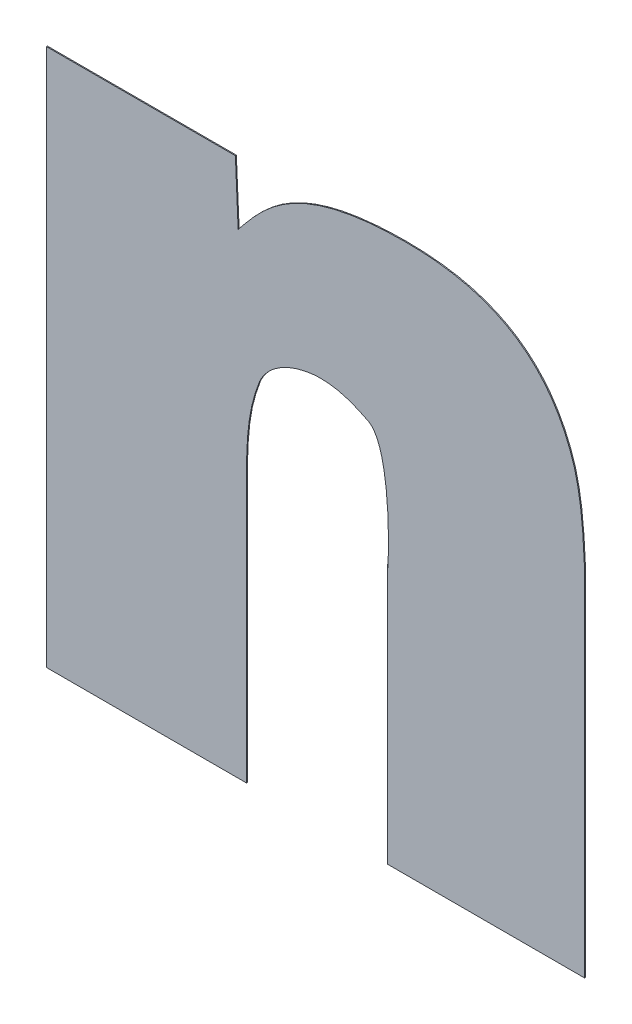
ISO-10303-21;
HEADER;
FILE_DESCRIPTION(('STEP AP214'),'2;1');
FILE_NAME('part.step','',(''),(''),'','','');
FILE_SCHEMA(('AUTOMOTIVE_DESIGN { 1 0 10303 214 1 1 1 1 }'));
ENDSEC;
DATA;
#1=APPLICATION_CONTEXT('core data for automotive mechanical design processes');
#2=APPLICATION_PROTOCOL_DEFINITION('international standard','automotive_design',2000,#1);
#3=PRODUCT_CONTEXT('',#1,'mechanical');
#4=PRODUCT('Part','Part','',(#3));
#5=PRODUCT_RELATED_PRODUCT_CATEGORY('part','',(#4));
#6=PRODUCT_DEFINITION_FORMATION('','',#4);
#7=PRODUCT_DEFINITION_CONTEXT('part definition',#1,'design');
#8=PRODUCT_DEFINITION('design','',#6,#7);
#9=PRODUCT_DEFINITION_SHAPE('','',#8);
#10=(LENGTH_UNIT() NAMED_UNIT(*) SI_UNIT(.MILLI.,.METRE.));
#11=(NAMED_UNIT(*) PLANE_ANGLE_UNIT() SI_UNIT($,.RADIAN.));
#12=(NAMED_UNIT(*) SI_UNIT($,.STERADIAN.) SOLID_ANGLE_UNIT());
#13=UNCERTAINTY_MEASURE_WITH_UNIT(LENGTH_MEASURE(1.E-05),#10,'distance_accuracy_value','');
#14=(GEOMETRIC_REPRESENTATION_CONTEXT(3) GLOBAL_UNCERTAINTY_ASSIGNED_CONTEXT((#13)) GLOBAL_UNIT_ASSIGNED_CONTEXT((#10,
#11,#12)) REPRESENTATION_CONTEXT('',''));
#15=CARTESIAN_POINT('',(0.,0.,0.));
#16=DIRECTION('',(0.,0.,1.));
#17=DIRECTION('',(1.,0.,0.));
#18=AXIS2_PLACEMENT_3D('',#15,#16,#17);
#19=CARTESIAN_POINT('',(2.2675373932652,-0.252027949944998,0.));
#20=DIRECTION('',(0.,1.,0.));
#21=DIRECTION('',(-1.,0.,0.));
#22=AXIS2_PLACEMENT_3D('',#19,#20,#21);
#23=PLANE('',#22);
#24=DIRECTION('',(1.,0.,0.));
#25=VECTOR('',#24,1.);
#26=CARTESIAN_POINT('',(2.2483595272321,-0.252027949944998,0.));
#27=LINE('',#26,#25);
#28=CARTESIAN_POINT('',(2.2483595272321,-0.252027949944998,0.));
#29=VERTEX_POINT('',#28);
#30=CARTESIAN_POINT('',(2.2675373932652,-0.252027949944998,0.));
#31=VERTEX_POINT('',#30);
#32=EDGE_CURVE('E11',#29,#31,#27,.T.);
#33=ORIENTED_EDGE('',*,*,#32,.F.);
#34=DIRECTION('',(0.,0.,1.));
#35=VECTOR('',#34,1.);
#36=CARTESIAN_POINT('',(2.2483595272321,-0.252027949944998,0.));
#37=LINE('',#36,#35);
#38=CARTESIAN_POINT('',(2.2483595272321,-0.252027949944998,0.0001));
#39=VERTEX_POINT('',#38);
#40=EDGE_CURVE('E24',#29,#39,#37,.T.);
#41=ORIENTED_EDGE('',*,*,#40,.T.);
#42=DIRECTION('',(-1.,0.,0.));
#43=VECTOR('',#42,1.);
#44=CARTESIAN_POINT('',(2.2483595272321,-0.252027949944998,0.0001));
#45=LINE('',#44,#43);
#46=CARTESIAN_POINT('',(2.2675373932652,-0.252027949944998,0.0001));
#47=VERTEX_POINT('',#46);
#48=EDGE_CURVE('E142',#47,#39,#45,.T.);
#49=ORIENTED_EDGE('',*,*,#48,.F.);
#50=DIRECTION('',(0.,0.,1.));
#51=VECTOR('',#50,1.);
#52=CARTESIAN_POINT('',(2.2675373932652,-0.252027949944998,0.));
#53=LINE('',#52,#51);
#54=EDGE_CURVE('E309',#31,#47,#53,.T.);
#55=ORIENTED_EDGE('',*,*,#54,.F.);
#56=EDGE_LOOP('',(#33,#41,#49,#55));
#57=FACE_BOUND('',#56,.T.);
#58=ADVANCED_FACE('F17',(#57),#23,.T.);
#59=CARTESIAN_POINT('',(2.2678194264937,-0.258364169610847,0.));
#60=DIRECTION('',(0.999010842697862,0.0444672483082399,0.));
#61=DIRECTION('',(-0.0444672483082399,0.999010842697862,0.));
#62=AXIS2_PLACEMENT_3D('',#59,#60,#61);
#63=PLANE('',#62);
#64=DIRECTION('',(0.0444672483082399,-0.999010842697862,0.));
#65=VECTOR('',#64,1.);
#66=CARTESIAN_POINT('',(2.2675373932652,-0.252027949944998,0.));
#67=LINE('',#66,#65);
#68=CARTESIAN_POINT('',(2.2678194264937,-0.258364169610847,0.));
#69=VERTEX_POINT('',#68);
#70=EDGE_CURVE('E307',#31,#69,#67,.T.);
#71=ORIENTED_EDGE('',*,*,#70,.F.);
#72=ORIENTED_EDGE('',*,*,#54,.T.);
#73=DIRECTION('',(-0.0444672483082399,0.999010842697862,0.));
#74=VECTOR('',#73,1.);
#75=CARTESIAN_POINT('',(2.2675373932652,-0.252027949944998,0.0001));
#76=LINE('',#75,#74);
#77=CARTESIAN_POINT('',(2.2678194264937,-0.258364169610847,0.0001));
#78=VERTEX_POINT('',#77);
#79=EDGE_CURVE('E305',#78,#47,#76,.T.);
#80=ORIENTED_EDGE('',*,*,#79,.F.);
#81=DIRECTION('',(0.,0.,1.));
#82=VECTOR('',#81,1.);
#83=CARTESIAN_POINT('',(2.2678194264937,-0.258364169610847,0.));
#84=LINE('',#83,#82);
#85=EDGE_CURVE('E299',#69,#78,#84,.T.);
#86=ORIENTED_EDGE('',*,*,#85,.F.);
#87=EDGE_LOOP('',(#71,#72,#80,#86));
#88=FACE_BOUND('',#87,.T.);
#89=ADVANCED_FACE('F359',(#88),#63,.T.);
#90=CARTESIAN_POINT('',(2.2848351001338,-0.250975047394927,0.));
#91=CARTESIAN_POINT('',(2.2848351001338,-0.250975047394927,0.0001));
#92=CARTESIAN_POINT('',(2.2735539969308,-0.250975047515781,0.));
#93=CARTESIAN_POINT('',(2.2735539969308,-0.250975047515781,0.0001));
#94=CARTESIAN_POINT('',(2.2704516958387,-0.255139675765826,0.));
#95=CARTESIAN_POINT('',(2.2704516958387,-0.255139675765826,0.0001));
#96=CARTESIAN_POINT('',(2.2678194264937,-0.258364169610847,0.));
#97=CARTESIAN_POINT('',(2.2678194264937,-0.258364169610847,0.0001));
#98=B_SPLINE_SURFACE_WITH_KNOTS('',3,1,((#90,#91),(#92,#93),(#94,#95),(#96,#97)),.UNSPECIFIED.,
.F.,.F.,.F.,(4,4),(2,2),(-1.,0.),(0.,1.E-05),.UNSPECIFIED.);
#99=CARTESIAN_POINT('',(2.2678194264937,-0.258364169610847,0.));
#100=CARTESIAN_POINT('',(2.2704516958387,-0.255139675765826,0.));
#101=CARTESIAN_POINT('',(2.2735539969308,-0.250975047515781,0.));
#102=CARTESIAN_POINT('',(2.2848351001338,-0.250975047394927,0.));
#103=B_SPLINE_CURVE_WITH_KNOTS('',3,(#99,#100,#101,#102),.UNSPECIFIED.,.F.,.F.,(4,4),(0.,1.),.UNSPECIFIED.);
#104=CARTESIAN_POINT('',(2.2848351001338,-0.250975047394927,0.));
#105=VERTEX_POINT('',#104);
#106=EDGE_CURVE('E292',#69,#105,#103,.T.);
#107=CARTESIAN_POINT('',(2.2848351001338,-0.250975047394927,0.0001));
#108=CARTESIAN_POINT('',(2.2735539969308,-0.250975047515781,0.0001));
#109=CARTESIAN_POINT('',(2.2704516958387,-0.255139675765826,0.0001));
#110=CARTESIAN_POINT('',(2.2678194264937,-0.258364169610847,0.0001));
#111=B_SPLINE_CURVE_WITH_KNOTS('',3,(#107,#108,#109,#110),.UNSPECIFIED.,.F.,.F.,(4,4),(-1.,0.),.UNSPECIFIED.);
#112=CARTESIAN_POINT('',(2.2848351001338,-0.250975047394927,0.0001));
#113=VERTEX_POINT('',#112);
#114=EDGE_CURVE('E287',#113,#78,#111,.T.);
#115=DIRECTION('',(0.,0.,1.));
#116=VECTOR('',#115,1.);
#117=CARTESIAN_POINT('',(2.2848351001338,-0.250975047394927,0.));
#118=LINE('',#117,#116);
#119=EDGE_CURVE('E281',#105,#113,#118,.T.);
#120=ORIENTED_EDGE('',*,*,#106,.F.);
#121=ORIENTED_EDGE('',*,*,#85,.T.);
#122=ORIENTED_EDGE('',*,*,#114,.F.);
#123=ORIENTED_EDGE('',*,*,#119,.F.);
#124=EDGE_LOOP('',(#120,#121,#122,#123));
#125=FACE_BOUND('',#124,.T.);
#126=ADVANCED_FACE('F355',(#125),#98,.T.);
#127=CARTESIAN_POINT('',(2.3019447956015,-0.262237359289623,0.));
#128=CARTESIAN_POINT('',(2.3019447956015,-0.262237359289623,0.0001));
#129=CARTESIAN_POINT('',(2.2994065417012,-0.253861133675748,0.));
#130=CARTESIAN_POINT('',(2.2994065417012,-0.253861133675748,0.0001));
#131=CARTESIAN_POINT('',(2.2931079243156,-0.250975047394936,0.));
#132=CARTESIAN_POINT('',(2.2931079243156,-0.250975047394936,0.0001));
#133=CARTESIAN_POINT('',(2.2848351001338,-0.250975047394927,0.));
#134=CARTESIAN_POINT('',(2.2848351001338,-0.250975047394927,0.0001));
#135=B_SPLINE_SURFACE_WITH_KNOTS('',3,1,((#127,#128),(#129,#130),(#131,#132),(#133,#134)),
.UNSPECIFIED.,.F.,.F.,.F.,(4,4),(2,2),(-1.,0.),(0.,1.E-05),.UNSPECIFIED.);
#136=CARTESIAN_POINT('',(2.2848351001338,-0.250975047394927,0.));
#137=CARTESIAN_POINT('',(2.2931079243156,-0.250975047394936,0.));
#138=CARTESIAN_POINT('',(2.2994065417012,-0.253861133675748,0.));
#139=CARTESIAN_POINT('',(2.3019447956015,-0.262237359289623,0.));
#140=B_SPLINE_CURVE_WITH_KNOTS('',3,(#136,#137,#138,#139),.UNSPECIFIED.,.F.,.F.,(4,4),(0.,1.),.UNSPECIFIED.);
#141=CARTESIAN_POINT('',(2.3019447956015,-0.262237359289623,0.));
#142=VERTEX_POINT('',#141);
#143=EDGE_CURVE('E274',#105,#142,#140,.T.);
#144=CARTESIAN_POINT('',(2.3019447956015,-0.262237359289623,0.0001));
#145=CARTESIAN_POINT('',(2.2994065417012,-0.253861133675748,0.0001));
#146=CARTESIAN_POINT('',(2.2931079243156,-0.250975047394936,0.0001));
#147=CARTESIAN_POINT('',(2.2848351001338,-0.250975047394927,0.0001));
#148=B_SPLINE_CURVE_WITH_KNOTS('',3,(#144,#145,#146,#147),.UNSPECIFIED.,.F.,.F.,(4,4),(-1.,0.),.UNSPECIFIED.);
#149=CARTESIAN_POINT('',(2.3019447956015,-0.262237359289623,0.0001));
#150=VERTEX_POINT('',#149);
#151=EDGE_CURVE('E269',#150,#113,#148,.T.);
#152=DIRECTION('',(0.,0.,1.));
#153=VECTOR('',#152,1.);
#154=CARTESIAN_POINT('',(2.3019447956015,-0.262237359289623,0.));
#155=LINE('',#154,#153);
#156=EDGE_CURVE('E263',#142,#150,#155,.T.);
#157=ORIENTED_EDGE('',*,*,#143,.F.);
#158=ORIENTED_EDGE('',*,*,#119,.T.);
#159=ORIENTED_EDGE('',*,*,#151,.F.);
#160=ORIENTED_EDGE('',*,*,#156,.F.);
#161=EDGE_LOOP('',(#157,#158,#159,#160));
#162=FACE_BOUND('',#161,.T.);
#163=ADVANCED_FACE('F351',(#162),#135,.T.);
#164=CARTESIAN_POINT('',(2.3029788873351,-0.270745209011472,0.));
#165=CARTESIAN_POINT('',(2.3029788873351,-0.270745209011472,0.0001));
#166=CARTESIAN_POINT('',(2.3027908694834,-0.26640196825252,0.));
#167=CARTESIAN_POINT('',(2.3027908694834,-0.26640196825252,0.0001));
#168=CARTESIAN_POINT('',(2.3025088427058,-0.264352576248992,0.));
#169=CARTESIAN_POINT('',(2.3025088427058,-0.264352576248992,0.0001));
#170=CARTESIAN_POINT('',(2.3019447956015,-0.262237359289623,0.));
#171=CARTESIAN_POINT('',(2.3019447956015,-0.262237359289623,0.0001));
#172=B_SPLINE_SURFACE_WITH_KNOTS('',3,1,((#164,#165),(#166,#167),(#168,#169),(#170,#171)),
.UNSPECIFIED.,.F.,.F.,.F.,(4,4),(2,2),(-1.,0.),(0.,1.E-05),.UNSPECIFIED.);
#173=CARTESIAN_POINT('',(2.3019447956015,-0.262237359289623,0.));
#174=CARTESIAN_POINT('',(2.3025088427058,-0.264352576248992,0.));
#175=CARTESIAN_POINT('',(2.3027908694834,-0.26640196825252,0.));
#176=CARTESIAN_POINT('',(2.3029788873351,-0.270745209011472,0.));
#177=B_SPLINE_CURVE_WITH_KNOTS('',3,(#173,#174,#175,#176),.UNSPECIFIED.,.F.,.F.,(4,4),(0.,1.),.UNSPECIFIED.);
#178=CARTESIAN_POINT('',(2.3029788873351,-0.270745209011472,0.));
#179=VERTEX_POINT('',#178);
#180=EDGE_CURVE('E256',#142,#179,#177,.T.);
#181=CARTESIAN_POINT('',(2.3029788873351,-0.270745209011472,0.0001));
#182=CARTESIAN_POINT('',(2.3027908694834,-0.26640196825252,0.0001));
#183=CARTESIAN_POINT('',(2.3025088427058,-0.264352576248992,0.0001));
#184=CARTESIAN_POINT('',(2.3019447956015,-0.262237359289623,0.0001));
#185=B_SPLINE_CURVE_WITH_KNOTS('',3,(#181,#182,#183,#184),.UNSPECIFIED.,.F.,.F.,(4,4),(-1.,0.),.UNSPECIFIED.);
#186=CARTESIAN_POINT('',(2.3029788873351,-0.270745209011472,0.0001));
#187=VERTEX_POINT('',#186);
#188=EDGE_CURVE('E251',#187,#150,#185,.T.);
#189=DIRECTION('',(0.,0.,1.));
#190=VECTOR('',#189,1.);
#191=CARTESIAN_POINT('',(2.3029788873351,-0.270745209011472,0.));
#192=LINE('',#191,#190);
#193=EDGE_CURVE('E248',#179,#187,#192,.T.);
#194=ORIENTED_EDGE('',*,*,#180,.F.);
#195=ORIENTED_EDGE('',*,*,#156,.T.);
#196=ORIENTED_EDGE('',*,*,#188,.F.);
#197=ORIENTED_EDGE('',*,*,#193,.F.);
#198=EDGE_LOOP('',(#194,#195,#196,#197));
#199=FACE_BOUND('',#198,.T.);
#200=ADVANCED_FACE('F347',(#199),#172,.T.);
#201=CARTESIAN_POINT('',(2.3029788873351,-0.306572124840331,0.));
#202=DIRECTION('',(1.,0.,0.));
#203=DIRECTION('',(0.,1.,0.));
#204=AXIS2_PLACEMENT_3D('',#201,#202,#203);
#205=PLANE('',#204);
#206=DIRECTION('',(0.,-1.,0.));
#207=VECTOR('',#206,1.);
#208=CARTESIAN_POINT('',(2.3029788873351,-0.270745209011472,0.));
#209=LINE('',#208,#207);
#210=CARTESIAN_POINT('',(2.3029788873351,-0.306572124840331,0.));
#211=VERTEX_POINT('',#210);
#212=EDGE_CURVE('E246',#179,#211,#209,.T.);
#213=ORIENTED_EDGE('',*,*,#212,.F.);
#214=ORIENTED_EDGE('',*,*,#193,.T.);
#215=DIRECTION('',(0.,1.,0.));
#216=VECTOR('',#215,1.);
#217=CARTESIAN_POINT('',(2.3029788873351,-0.270745209011472,0.0001));
#218=LINE('',#217,#216);
#219=CARTESIAN_POINT('',(2.3029788873351,-0.306572124840331,0.0001));
#220=VERTEX_POINT('',#219);
#221=EDGE_CURVE('E243',#220,#187,#218,.T.);
#222=ORIENTED_EDGE('',*,*,#221,.F.);
#223=DIRECTION('',(0.,0.,1.));
#224=VECTOR('',#223,1.);
#225=CARTESIAN_POINT('',(2.3029788873351,-0.306572124840331,0.));
#226=LINE('',#225,#224);
#227=EDGE_CURVE('E240',#211,#220,#226,.T.);
#228=ORIENTED_EDGE('',*,*,#227,.F.);
#229=EDGE_LOOP('',(#213,#214,#222,#228));
#230=FACE_BOUND('',#229,.T.);
#231=ADVANCED_FACE('F343',(#230),#205,.T.);
#232=CARTESIAN_POINT('',(2.2829549280673,-0.306572124840331,0.));
#233=DIRECTION('',(0.,-1.,0.));
#234=DIRECTION('',(1.,0.,0.));
#235=AXIS2_PLACEMENT_3D('',#232,#233,#234);
#236=PLANE('',#235);
#237=DIRECTION('',(-1.,0.,0.));
#238=VECTOR('',#237,1.);
#239=CARTESIAN_POINT('',(2.3029788873351,-0.306572124840331,0.));
#240=LINE('',#239,#238);
#241=CARTESIAN_POINT('',(2.2829549280673,-0.306572124840331,0.));
#242=VERTEX_POINT('',#241);
#243=EDGE_CURVE('E238',#211,#242,#240,.T.);
#244=ORIENTED_EDGE('',*,*,#243,.F.);
#245=ORIENTED_EDGE('',*,*,#227,.T.);
#246=DIRECTION('',(1.,0.,0.));
#247=VECTOR('',#246,1.);
#248=CARTESIAN_POINT('',(2.3029788873351,-0.306572124840331,0.0001));
#249=LINE('',#248,#247);
#250=CARTESIAN_POINT('',(2.2829549280673,-0.306572124840331,0.0001));
#251=VERTEX_POINT('',#250);
#252=EDGE_CURVE('E235',#251,#220,#249,.T.);
#253=ORIENTED_EDGE('',*,*,#252,.F.);
#254=DIRECTION('',(0.,0.,1.));
#255=VECTOR('',#254,1.);
#256=CARTESIAN_POINT('',(2.2829549280673,-0.306572124840331,0.));
#257=LINE('',#256,#255);
#258=EDGE_CURVE('E232',#242,#251,#257,.T.);
#259=ORIENTED_EDGE('',*,*,#258,.F.);
#260=EDGE_LOOP('',(#244,#245,#253,#259));
#261=FACE_BOUND('',#260,.T.);
#262=ADVANCED_FACE('F339',(#261),#236,.T.);
#263=CARTESIAN_POINT('',(2.2829549280673,-0.280211926553894,0.));
#264=DIRECTION('',(-1.,0.,0.));
#265=DIRECTION('',(0.,-1.,0.));
#266=AXIS2_PLACEMENT_3D('',#263,#264,#265);
#267=PLANE('',#266);
#268=DIRECTION('',(0.,1.,0.));
#269=VECTOR('',#268,1.);
#270=CARTESIAN_POINT('',(2.2829549280673,-0.306572124840331,0.));
#271=LINE('',#270,#269);
#272=CARTESIAN_POINT('',(2.2829549280673,-0.280211926553894,0.));
#273=VERTEX_POINT('',#272);
#274=EDGE_CURVE('E230',#242,#273,#271,.T.);
#275=ORIENTED_EDGE('',*,*,#274,.F.);
#276=ORIENTED_EDGE('',*,*,#258,.T.);
#277=DIRECTION('',(0.,-1.,0.));
#278=VECTOR('',#277,1.);
#279=CARTESIAN_POINT('',(2.2829549280673,-0.306572124840331,0.0001));
#280=LINE('',#279,#278);
#281=CARTESIAN_POINT('',(2.2829549280673,-0.280211926553894,0.0001));
#282=VERTEX_POINT('',#281);
#283=EDGE_CURVE('E227',#282,#251,#280,.T.);
#284=ORIENTED_EDGE('',*,*,#283,.F.);
#285=DIRECTION('',(0.,0.,1.));
#286=VECTOR('',#285,1.);
#287=CARTESIAN_POINT('',(2.2829549280673,-0.280211926553894,0.));
#288=LINE('',#287,#286);
#289=EDGE_CURVE('E221',#273,#282,#288,.T.);
#290=ORIENTED_EDGE('',*,*,#289,.F.);
#291=EDGE_LOOP('',(#275,#276,#284,#290));
#292=FACE_BOUND('',#291,.T.);
#293=ADVANCED_FACE('F335',(#292),#267,.T.);
#294=CARTESIAN_POINT('',(2.2809807406241,-0.268592376870256,0.));
#295=CARTESIAN_POINT('',(2.2809807406241,-0.268592376870256,0.0001));
#296=CARTESIAN_POINT('',(2.2838010081832,-0.269917907222783,0.));
#297=CARTESIAN_POINT('',(2.2838010081832,-0.269917907222783,0.0001));
#298=CARTESIAN_POINT('',(2.2829549281335,-0.283351829838579,0.));
#299=CARTESIAN_POINT('',(2.2829549281335,-0.283351829838579,0.0001));
#300=CARTESIAN_POINT('',(2.2829549280673,-0.280211926553894,0.));
#301=CARTESIAN_POINT('',(2.2829549280673,-0.280211926553894,0.0001));
#302=B_SPLINE_SURFACE_WITH_KNOTS('',3,1,((#294,#295),(#296,#297),(#298,#299),(#300,#301)),
.UNSPECIFIED.,.F.,.F.,.F.,(4,4),(2,2),(-1.,0.),(0.,1.E-05),.UNSPECIFIED.);
#303=CARTESIAN_POINT('',(2.2829549280673,-0.280211926553894,0.));
#304=CARTESIAN_POINT('',(2.2829549281335,-0.283351829838579,0.));
#305=CARTESIAN_POINT('',(2.2838010081832,-0.269917907222783,0.));
#306=CARTESIAN_POINT('',(2.2809807406241,-0.268592376870256,0.));
#307=B_SPLINE_CURVE_WITH_KNOTS('',3,(#303,#304,#305,#306),.UNSPECIFIED.,.F.,.F.,(4,4),(0.,1.),.UNSPECIFIED.);
#308=CARTESIAN_POINT('',(2.2809807406241,-0.268592376870256,0.));
#309=VERTEX_POINT('',#308);
#310=EDGE_CURVE('E214',#273,#309,#307,.T.);
#311=CARTESIAN_POINT('',(2.2809807406241,-0.268592376870256,0.0001));
#312=CARTESIAN_POINT('',(2.2838010081832,-0.269917907222783,0.0001));
#313=CARTESIAN_POINT('',(2.2829549281335,-0.283351829838579,0.0001));
#314=CARTESIAN_POINT('',(2.2829549280673,-0.280211926553894,0.0001));
#315=B_SPLINE_CURVE_WITH_KNOTS('',3,(#311,#312,#313,#314),.UNSPECIFIED.,.F.,.F.,(4,4),(-1.,0.),.UNSPECIFIED.);
#316=CARTESIAN_POINT('',(2.2809807406241,-0.268592376870256,0.0001));
#317=VERTEX_POINT('',#316);
#318=EDGE_CURVE('E209',#317,#282,#315,.T.);
#319=DIRECTION('',(0.,0.,1.));
#320=VECTOR('',#319,1.);
#321=CARTESIAN_POINT('',(2.2809807406241,-0.268592376870256,0.));
#322=LINE('',#321,#320);
#323=EDGE_CURVE('E203',#309,#317,#322,.T.);
#324=CARTESIAN_POINT('',(2.2809807406241,-0.268592376870256,0.));
#325=CARTESIAN_POINT('',(2.2809807406241,-0.268592376870256,0.0001));
#326=CARTESIAN_POINT('',(2.2838010081832,-0.269917907222783,0.));
#327=CARTESIAN_POINT('',(2.2838010081832,-0.269917907222783,0.0001));
#328=CARTESIAN_POINT('',(2.2829549281335,-0.283351829838579,0.));
#329=CARTESIAN_POINT('',(2.2829549281335,-0.283351829838579,0.0001));
#330=CARTESIAN_POINT('',(2.2829549280673,-0.280211926553894,0.));
#331=CARTESIAN_POINT('',(2.2829549280673,-0.280211926553894,0.0001));
#332=CARTESIAN_POINT('',(2.2829549280632,-0.280017252550244,0.));
#333=CARTESIAN_POINT('',(2.2829549280632,-0.280017252550244,0.0001));
#334=CARTESIAN_POINT('',(2.28295492805909,-0.279822578546593,0.));
#335=CARTESIAN_POINT('',(2.28295492805909,-0.279822578546593,0.0001));
#336=CARTESIAN_POINT('',(2.28295492805499,-0.279627904542943,0.));
#337=CARTESIAN_POINT('',(2.28295492805499,-0.279627904542943,0.0001));
#338=B_SPLINE_SURFACE_WITH_KNOTS('',3,1,((#324,#325),(#326,#327),(#328,#329),(#330,#331),(#332,
#333),(#334,#335),(#336,#337)),.UNSPECIFIED.,.F.,.F.,.F.,(4,3,4),(2,2),(-1.,0.,0.062),(0.,
1.E-05),.UNSPECIFIED.);
#339=ORIENTED_EDGE('',*,*,#310,.F.);
#340=ORIENTED_EDGE('',*,*,#289,.T.);
#341=ORIENTED_EDGE('',*,*,#318,.F.);
#342=ORIENTED_EDGE('',*,*,#323,.F.);
#343=EDGE_LOOP('',(#339,#340,#341,#342));
#344=FACE_BOUND('',#343,.T.);
#345=ADVANCED_FACE('F331',(#344),#338,.T.);
#346=CARTESIAN_POINT('',(2.2760922506754,-0.267266859401695,0.));
#347=CARTESIAN_POINT('',(2.2760922506754,-0.267266859401695,0.0001));
#348=CARTESIAN_POINT('',(2.2782544559704,-0.267219838811514,0.));
#349=CARTESIAN_POINT('',(2.2782544559704,-0.267219838811514,0.0001));
#350=CARTESIAN_POINT('',(2.2800406449145,-0.268131731198237,0.));
#351=CARTESIAN_POINT('',(2.2800406449145,-0.268131731198237,0.0001));
#352=CARTESIAN_POINT('',(2.2809807406241,-0.268592376870256,0.));
#353=CARTESIAN_POINT('',(2.2809807406241,-0.268592376870256,0.0001));
#354=B_SPLINE_SURFACE_WITH_KNOTS('',3,1,((#346,#347),(#348,#349),(#350,#351),(#352,#353)),
.UNSPECIFIED.,.F.,.F.,.F.,(4,4),(2,2),(-1.,0.),(0.,1.E-05),.UNSPECIFIED.);
#355=CARTESIAN_POINT('',(2.2809807406241,-0.268592376870256,0.));
#356=CARTESIAN_POINT('',(2.2800406449145,-0.268131731198237,0.));
#357=CARTESIAN_POINT('',(2.2782544559704,-0.267219838811514,0.));
#358=CARTESIAN_POINT('',(2.2760922506754,-0.267266859401695,0.));
#359=B_SPLINE_CURVE_WITH_KNOTS('',3,(#355,#356,#357,#358),.UNSPECIFIED.,.F.,.F.,(4,4),(0.,1.),.UNSPECIFIED.);
#360=CARTESIAN_POINT('',(2.2760922506754,-0.267266859401695,0.));
#361=VERTEX_POINT('',#360);
#362=EDGE_CURVE('E196',#309,#361,#359,.T.);
#363=CARTESIAN_POINT('',(2.2760922506754,-0.267266859401695,0.0001));
#364=CARTESIAN_POINT('',(2.2782544559704,-0.267219838811514,0.0001));
#365=CARTESIAN_POINT('',(2.2800406449145,-0.268131731198237,0.0001));
#366=CARTESIAN_POINT('',(2.2809807406241,-0.268592376870256,0.0001));
#367=B_SPLINE_CURVE_WITH_KNOTS('',3,(#363,#364,#365,#366),.UNSPECIFIED.,.F.,.F.,(4,4),(-1.,0.),.UNSPECIFIED.);
#368=CARTESIAN_POINT('',(2.2760922506754,-0.267266859401695,0.0001));
#369=VERTEX_POINT('',#368);
#370=EDGE_CURVE('E191',#369,#317,#367,.T.);
#371=DIRECTION('',(0.,0.,1.));
#372=VECTOR('',#371,1.);
#373=CARTESIAN_POINT('',(2.2760922506754,-0.267266859401695,0.));
#374=LINE('',#373,#372);
#375=EDGE_CURVE('E185',#361,#369,#374,.T.);
#376=ORIENTED_EDGE('',*,*,#362,.F.);
#377=ORIENTED_EDGE('',*,*,#323,.T.);
#378=ORIENTED_EDGE('',*,*,#370,.F.);
#379=ORIENTED_EDGE('',*,*,#375,.F.);
#380=EDGE_LOOP('',(#376,#377,#378,#379));
#381=FACE_BOUND('',#380,.T.);
#382=ADVANCED_FACE('F327',(#381),#354,.T.);
#383=CARTESIAN_POINT('',(2.2699816446904,-0.270669985098445,0.));
#384=CARTESIAN_POINT('',(2.2699816446904,-0.270669985098445,0.0001));
#385=CARTESIAN_POINT('',(2.2702046466505,-0.27015485303437,0.));
#386=CARTESIAN_POINT('',(2.2702046466505,-0.27015485303437,0.0001));
#387=CARTESIAN_POINT('',(2.2705275909168,-0.269696540122708,0.));
#388=CARTESIAN_POINT('',(2.2705275909168,-0.269696540122708,0.0001));
#389=CARTESIAN_POINT('',(2.2713239133157,-0.268887497180456,0.));
#390=CARTESIAN_POINT('',(2.2713239133157,-0.268887497180456,0.0001));
#391=CARTESIAN_POINT('',(2.2717945972617,-0.268545208531733,0.));
#392=CARTESIAN_POINT('',(2.2717945972617,-0.268545208531733,0.0001));
#393=CARTESIAN_POINT('',(2.2728730676536,-0.267946178592523,0.));
#394=CARTESIAN_POINT('',(2.2728730676536,-0.267946178592523,0.0001));
#395=CARTESIAN_POINT('',(2.2735010583055,-0.267703857835772,0.));
#396=CARTESIAN_POINT('',(2.2735010583055,-0.267703857835772,0.0001));
#397=CARTESIAN_POINT('',(2.2747744691879,-0.267373272148791,0.));
#398=CARTESIAN_POINT('',(2.2747744691879,-0.267373272148791,0.0001));
#399=CARTESIAN_POINT('',(2.2754375420682,-0.267279447326715,0.));
#400=CARTESIAN_POINT('',(2.2754375420682,-0.267279447326715,0.0001));
#401=CARTESIAN_POINT('',(2.2760922506754,-0.267266859401695,0.));
#402=CARTESIAN_POINT('',(2.2760922506754,-0.267266859401695,0.0001));
#403=B_SPLINE_SURFACE_WITH_KNOTS('',3,1,((#383,#384),(#385,#386),(#387,#388),(#389,#390),(#391,
#392),(#393,#394),(#395,#396),(#397,#398),(#399,#400),(#401,#402)),.UNSPECIFIED.,.F.,.F.,.F.,(4,
2,2,2,4),(2,2),(-0.0045321042457117,-0.0034931688025108,-0.0024311859715857,-0.0012118245794792,
0.),(0.,1.E-05),.UNSPECIFIED.);
#404=CARTESIAN_POINT('',(2.2760922506754,-0.267266859401695,0.));
#405=CARTESIAN_POINT('',(2.2754375420682,-0.267279447326715,0.));
#406=CARTESIAN_POINT('',(2.2747744691879,-0.267373272148791,0.));
#407=CARTESIAN_POINT('',(2.2735010583055,-0.267703857835772,0.));
#408=CARTESIAN_POINT('',(2.2728730676536,-0.267946178592523,0.));
#409=CARTESIAN_POINT('',(2.2717945972617,-0.268545208531733,0.));
#410=CARTESIAN_POINT('',(2.2713239133157,-0.268887497180456,0.));
#411=CARTESIAN_POINT('',(2.2705275909168,-0.269696540122708,0.));
#412=CARTESIAN_POINT('',(2.2702046466505,-0.27015485303437,0.));
#413=CARTESIAN_POINT('',(2.2699816446904,-0.270669985098445,0.));
#414=B_SPLINE_CURVE_WITH_KNOTS('',3,(#404,#405,#406,#407,#408,#409,#410,#411,#412,#413),
.UNSPECIFIED.,.F.,.F.,(4,2,2,2,4),(0.,0.0012118245794792,0.0024311859715857,0.0034931688025108,
0.0045321042457117),.UNSPECIFIED.);
#415=CARTESIAN_POINT('',(2.2699816446904,-0.270669985098445,0.));
#416=VERTEX_POINT('',#415);
#417=EDGE_CURVE('E178',#361,#416,#414,.T.);
#418=CARTESIAN_POINT('',(2.2699816446904,-0.270669985098445,0.0001));
#419=CARTESIAN_POINT('',(2.2702046466505,-0.27015485303437,0.0001));
#420=CARTESIAN_POINT('',(2.2705275909168,-0.269696540122708,0.0001));
#421=CARTESIAN_POINT('',(2.2713239133157,-0.268887497180456,0.0001));
#422=CARTESIAN_POINT('',(2.2717945972617,-0.268545208531733,0.0001));
#423=CARTESIAN_POINT('',(2.2728730676536,-0.267946178592523,0.0001));
#424=CARTESIAN_POINT('',(2.2735010583055,-0.267703857835772,0.0001));
#425=CARTESIAN_POINT('',(2.2747744691879,-0.267373272148791,0.0001));
#426=CARTESIAN_POINT('',(2.2754375420682,-0.267279447326715,0.0001));
#427=CARTESIAN_POINT('',(2.2760922506754,-0.267266859401695,0.0001));
#428=B_SPLINE_CURVE_WITH_KNOTS('',3,(#418,#419,#420,#421,#422,#423,#424,#425,#426,#427),
.UNSPECIFIED.,.F.,.F.,(4,2,2,2,4),(-0.0045321042457117,-0.0034931688025108,-0.0024311859715857,
-0.0012118245794792,0.),.UNSPECIFIED.);
#429=CARTESIAN_POINT('',(2.2699816446904,-0.270669985098445,0.0001));
#430=VERTEX_POINT('',#429);
#431=EDGE_CURVE('E173',#430,#369,#428,.T.);
#432=DIRECTION('',(0.,0.,1.));
#433=VECTOR('',#432,1.);
#434=CARTESIAN_POINT('',(2.2699816446904,-0.270669985098445,0.));
#435=LINE('',#434,#433);
#436=EDGE_CURVE('E167',#416,#430,#435,.T.);
#437=ORIENTED_EDGE('',*,*,#417,.F.);
#438=ORIENTED_EDGE('',*,*,#375,.T.);
#439=ORIENTED_EDGE('',*,*,#431,.F.);
#440=ORIENTED_EDGE('',*,*,#436,.F.);
#441=EDGE_LOOP('',(#437,#438,#439,#440));
#442=FACE_BOUND('',#441,.T.);
#443=ADVANCED_FACE('F323',(#442),#403,.T.);
#444=CARTESIAN_POINT('',(2.2686655068265,-0.281274234512179,0.));
#445=CARTESIAN_POINT('',(2.2686655068265,-0.281274234512179,0.0001));
#446=CARTESIAN_POINT('',(2.2685715238114,-0.275755878984101,0.));
#447=CARTESIAN_POINT('',(2.2685715238114,-0.275755878984101,0.0001));
#448=CARTESIAN_POINT('',(2.26894753366,-0.273321045860947,0.));
#449=CARTESIAN_POINT('',(2.26894753366,-0.273321045860947,0.0001));
#450=CARTESIAN_POINT('',(2.2699816446904,-0.270669985098445,0.));
#451=CARTESIAN_POINT('',(2.2699816446904,-0.270669985098445,0.0001));
#452=B_SPLINE_SURFACE_WITH_KNOTS('',3,1,((#444,#445),(#446,#447),(#448,#449),(#450,#451)),
.UNSPECIFIED.,.F.,.F.,.F.,(4,4),(2,2),(-1.,0.),(0.,1.E-05),.UNSPECIFIED.);
#453=CARTESIAN_POINT('',(2.2699816446904,-0.270669985098445,0.));
#454=CARTESIAN_POINT('',(2.26894753366,-0.273321045860947,0.));
#455=CARTESIAN_POINT('',(2.2685715238114,-0.275755878984101,0.));
#456=CARTESIAN_POINT('',(2.2686655068265,-0.281274234512179,0.));
#457=B_SPLINE_CURVE_WITH_KNOTS('',3,(#453,#454,#455,#456),.UNSPECIFIED.,.F.,.F.,(4,4),(0.,1.),.UNSPECIFIED.);
#458=CARTESIAN_POINT('',(2.2686655068265,-0.281274234512179,0.));
#459=VERTEX_POINT('',#458);
#460=EDGE_CURVE('E160',#416,#459,#457,.T.);
#461=CARTESIAN_POINT('',(2.2686655068265,-0.281274234512179,0.0001));
#462=CARTESIAN_POINT('',(2.2685715238114,-0.275755878984101,0.0001));
#463=CARTESIAN_POINT('',(2.26894753366,-0.273321045860947,0.0001));
#464=CARTESIAN_POINT('',(2.2699816446904,-0.270669985098445,0.0001));
#465=B_SPLINE_CURVE_WITH_KNOTS('',3,(#461,#462,#463,#464),.UNSPECIFIED.,.F.,.F.,(4,4),(-1.,0.),.UNSPECIFIED.);
#466=CARTESIAN_POINT('',(2.2686655068265,-0.281274234512179,0.0001));
#467=VERTEX_POINT('',#466);
#468=EDGE_CURVE('E155',#467,#430,#465,.T.);
#469=DIRECTION('',(0.,0.,1.));
#470=VECTOR('',#469,1.);
#471=CARTESIAN_POINT('',(2.2686655068265,-0.281274234512179,0.));
#472=LINE('',#471,#470);
#473=EDGE_CURVE('E152',#459,#467,#472,.T.);
#474=ORIENTED_EDGE('',*,*,#460,.F.);
#475=ORIENTED_EDGE('',*,*,#436,.T.);
#476=ORIENTED_EDGE('',*,*,#468,.F.);
#477=ORIENTED_EDGE('',*,*,#473,.F.);
#478=EDGE_LOOP('',(#474,#475,#476,#477));
#479=FACE_BOUND('',#478,.T.);
#480=ADVANCED_FACE('F319',(#479),#452,.T.);
#481=CARTESIAN_POINT('',(2.2686655068265,-0.306590916304069,0.));
#482=DIRECTION('',(1.,0.,0.));
#483=DIRECTION('',(0.,1.,0.));
#484=AXIS2_PLACEMENT_3D('',#481,#482,#483);
#485=PLANE('',#484);
#486=DIRECTION('',(0.,-1.,0.));
#487=VECTOR('',#486,1.);
#488=CARTESIAN_POINT('',(2.2686655068265,-0.281274234512179,0.));
#489=LINE('',#488,#487);
#490=CARTESIAN_POINT('',(2.2686655068265,-0.306590916304069,0.));
#491=VERTEX_POINT('',#490);
#492=EDGE_CURVE('E150',#459,#491,#489,.T.);
#493=ORIENTED_EDGE('',*,*,#492,.F.);
#494=ORIENTED_EDGE('',*,*,#473,.T.);
#495=DIRECTION('',(0.,1.,0.));
#496=VECTOR('',#495,1.);
#497=CARTESIAN_POINT('',(2.2686655068265,-0.281274234512179,0.0001));
#498=LINE('',#497,#496);
#499=CARTESIAN_POINT('',(2.2686655068265,-0.306590916304069,0.0001));
#500=VERTEX_POINT('',#499);
#501=EDGE_CURVE('E148',#500,#467,#498,.T.);
#502=ORIENTED_EDGE('',*,*,#501,.F.);
#503=DIRECTION('',(0.,0.,1.));
#504=VECTOR('',#503,1.);
#505=CARTESIAN_POINT('',(2.2686655068265,-0.306590916304069,0.));
#506=LINE('',#505,#504);
#507=EDGE_CURVE('E127',#491,#500,#506,.T.);
#508=ORIENTED_EDGE('',*,*,#507,.F.);
#509=EDGE_LOOP('',(#493,#494,#502,#508));
#510=FACE_BOUND('',#509,.T.);
#511=ADVANCED_FACE('F317',(#510),#485,.T.);
#512=CARTESIAN_POINT('',(2.2483595272321,-0.306590916304069,0.));
#513=DIRECTION('',(0.,-1.,0.));
#514=DIRECTION('',(1.,0.,0.));
#515=AXIS2_PLACEMENT_3D('',#512,#513,#514);
#516=PLANE('',#515);
#517=DIRECTION('',(-1.,0.,0.));
#518=VECTOR('',#517,1.);
#519=CARTESIAN_POINT('',(2.2686655068265,-0.306590916304069,0.));
#520=LINE('',#519,#518);
#521=CARTESIAN_POINT('',(2.2483595272321,-0.306590916304069,0.));
#522=VERTEX_POINT('',#521);
#523=EDGE_CURVE('E131',#491,#522,#520,.T.);
#524=ORIENTED_EDGE('',*,*,#523,.F.);
#525=ORIENTED_EDGE('',*,*,#507,.T.);
#526=DIRECTION('',(1.,0.,0.));
#527=VECTOR('',#526,1.);
#528=CARTESIAN_POINT('',(2.2686655068265,-0.306590916304069,0.0001));
#529=LINE('',#528,#527);
#530=CARTESIAN_POINT('',(2.2483595272321,-0.306590916304069,0.0001));
#531=VERTEX_POINT('',#530);
#532=EDGE_CURVE('E120',#531,#500,#529,.T.);
#533=ORIENTED_EDGE('',*,*,#532,.F.);
#534=DIRECTION('',(0.,0.,1.));
#535=VECTOR('',#534,1.);
#536=CARTESIAN_POINT('',(2.2483595272321,-0.306590916304069,0.));
#537=LINE('',#536,#535);
#538=EDGE_CURVE('E124',#522,#531,#537,.T.);
#539=ORIENTED_EDGE('',*,*,#538,.F.);
#540=EDGE_LOOP('',(#524,#525,#533,#539));
#541=FACE_BOUND('',#540,.T.);
#542=ADVANCED_FACE('F123',(#541),#516,.T.);
#543=CARTESIAN_POINT('',(2.2483595272321,-0.252027949944998,0.));
#544=DIRECTION('',(-1.,0.,0.));
#545=DIRECTION('',(0.,-1.,0.));
#546=AXIS2_PLACEMENT_3D('',#543,#544,#545);
#547=PLANE('',#546);
#548=DIRECTION('',(0.,1.,0.));
#549=VECTOR('',#548,1.);
#550=CARTESIAN_POINT('',(2.2483595272321,-0.306590916304069,0.));
#551=LINE('',#550,#549);
#552=EDGE_CURVE('E137',#522,#29,#551,.T.);
#553=ORIENTED_EDGE('',*,*,#552,.F.);
#554=ORIENTED_EDGE('',*,*,#538,.T.);
#555=DIRECTION('',(0.,-1.,0.));
#556=VECTOR('',#555,1.);
#557=CARTESIAN_POINT('',(2.2483595272321,-0.306590916304069,0.0001));
#558=LINE('',#557,#556);
#559=EDGE_CURVE('E136',#39,#531,#558,.T.);
#560=ORIENTED_EDGE('',*,*,#559,.F.);
#561=ORIENTED_EDGE('',*,*,#40,.F.);
#562=EDGE_LOOP('',(#553,#554,#560,#561));
#563=FACE_BOUND('',#562,.T.);
#564=ADVANCED_FACE('F135',(#563),#547,.T.);
#565=CARTESIAN_POINT('',(2.274249033591,-0.280950924561158,0.));
#566=DIRECTION('',(0.,0.,1.));
#567=DIRECTION('',(1.,0.,0.));
#568=AXIS2_PLACEMENT_3D('',#565,#566,#567);
#569=PLANE('',#568);
#570=ORIENTED_EDGE('',*,*,#552,.T.);
#571=ORIENTED_EDGE('',*,*,#32,.T.);
#572=ORIENTED_EDGE('',*,*,#70,.T.);
#573=ORIENTED_EDGE('',*,*,#106,.T.);
#574=ORIENTED_EDGE('',*,*,#143,.T.);
#575=ORIENTED_EDGE('',*,*,#180,.T.);
#576=ORIENTED_EDGE('',*,*,#212,.T.);
#577=ORIENTED_EDGE('',*,*,#243,.T.);
#578=ORIENTED_EDGE('',*,*,#274,.T.);
#579=ORIENTED_EDGE('',*,*,#310,.T.);
#580=ORIENTED_EDGE('',*,*,#362,.T.);
#581=ORIENTED_EDGE('',*,*,#417,.T.);
#582=ORIENTED_EDGE('',*,*,#460,.T.);
#583=ORIENTED_EDGE('',*,*,#492,.T.);
#584=ORIENTED_EDGE('',*,*,#523,.T.);
#585=EDGE_LOOP('',(#570,#571,#572,#573,#574,#575,#576,#577,#578,#579,#580,#581,#582,#583,#584));
#586=FACE_BOUND('',#585,.T.);
#587=ADVANCED_FACE('F312',(#586),#569,.F.);
#588=CARTESIAN_POINT('',(2.274249033591,-0.280950924561158,0.0001));
#589=DIRECTION('',(0.,0.,1.));
#590=DIRECTION('',(1.,0.,0.));
#591=AXIS2_PLACEMENT_3D('',#588,#589,#590);
#592=PLANE('',#591);
#593=ORIENTED_EDGE('',*,*,#559,.T.);
#594=ORIENTED_EDGE('',*,*,#532,.T.);
#595=ORIENTED_EDGE('',*,*,#501,.T.);
#596=ORIENTED_EDGE('',*,*,#468,.T.);
#597=ORIENTED_EDGE('',*,*,#431,.T.);
#598=ORIENTED_EDGE('',*,*,#370,.T.);
#599=ORIENTED_EDGE('',*,*,#318,.T.);
#600=ORIENTED_EDGE('',*,*,#283,.T.);
#601=ORIENTED_EDGE('',*,*,#252,.T.);
#602=ORIENTED_EDGE('',*,*,#221,.T.);
#603=ORIENTED_EDGE('',*,*,#188,.T.);
#604=ORIENTED_EDGE('',*,*,#151,.T.);
#605=ORIENTED_EDGE('',*,*,#114,.T.);
#606=ORIENTED_EDGE('',*,*,#79,.T.);
#607=ORIENTED_EDGE('',*,*,#48,.T.);
#608=EDGE_LOOP('',(#593,#594,#595,#596,#597,#598,#599,#600,#601,#602,#603,#604,#605,#606,#607));
#609=FACE_BOUND('',#608,.T.);
#610=ADVANCED_FACE('F140',(#609),#592,.T.);
#611=CLOSED_SHELL('',(#58,#89,#126,#163,#200,#231,#262,#293,#345,#382,#443,#480,#511,#542,#564,
#587,#610));
#612=MANIFOLD_SOLID_BREP('B1',#611);
#613=ADVANCED_BREP_SHAPE_REPRESENTATION('',(#18,#612),#14);
#614=SHAPE_DEFINITION_REPRESENTATION(#9,#613);
ENDSEC;
END-ISO-10303-21;
